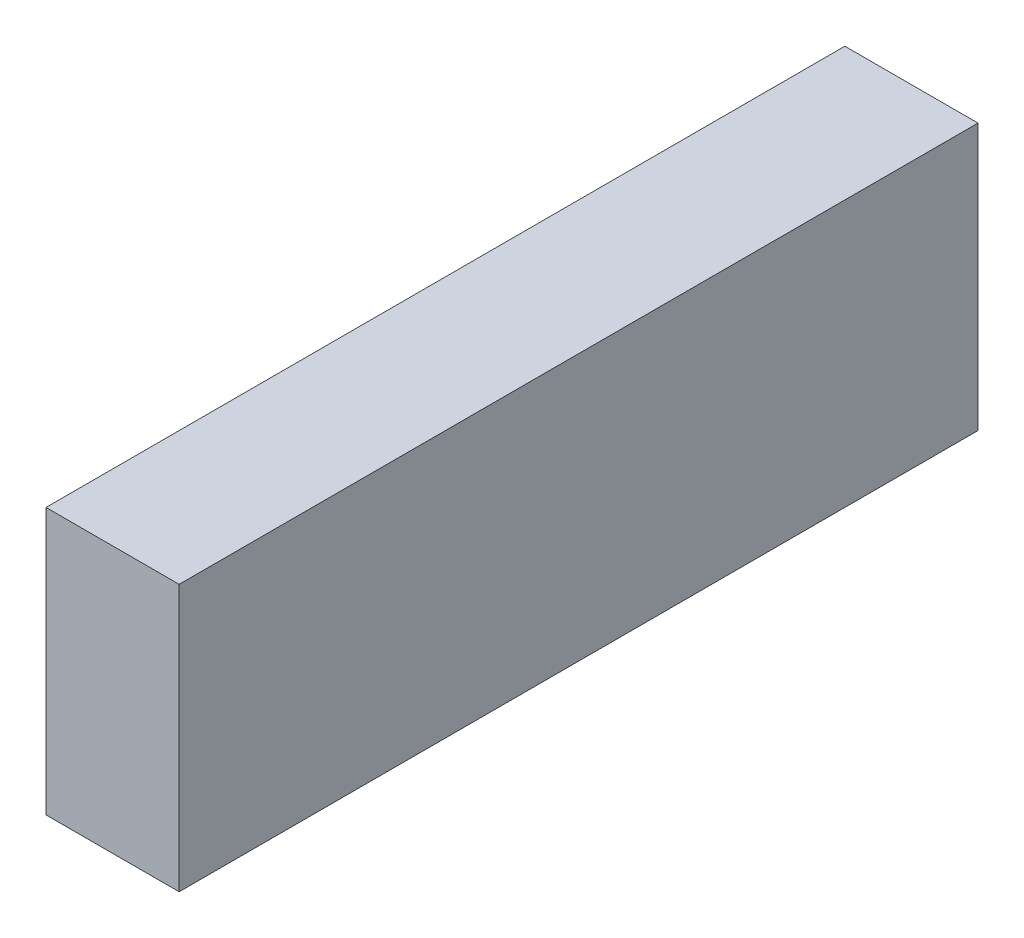
ISO-10303-21;
HEADER;
FILE_DESCRIPTION(('STEP AP214'),'2;1');
FILE_NAME('part.step','',(''),(''),'','','');
FILE_SCHEMA(('AUTOMOTIVE_DESIGN { 1 0 10303 214 1 1 1 1 }'));
ENDSEC;
DATA;
#1=APPLICATION_CONTEXT('core data for automotive mechanical design processes');
#2=APPLICATION_PROTOCOL_DEFINITION('international standard','automotive_design',2000,#1);
#3=PRODUCT_CONTEXT('',#1,'mechanical');
#4=PRODUCT('Part','Part','',(#3));
#5=PRODUCT_RELATED_PRODUCT_CATEGORY('part','',(#4));
#6=PRODUCT_DEFINITION_FORMATION('','',#4);
#7=PRODUCT_DEFINITION_CONTEXT('part definition',#1,'design');
#8=PRODUCT_DEFINITION('design','',#6,#7);
#9=PRODUCT_DEFINITION_SHAPE('','',#8);
#10=(LENGTH_UNIT() NAMED_UNIT(*) SI_UNIT(.MILLI.,.METRE.));
#11=(NAMED_UNIT(*) PLANE_ANGLE_UNIT() SI_UNIT($,.RADIAN.));
#12=(NAMED_UNIT(*) SI_UNIT($,.STERADIAN.) SOLID_ANGLE_UNIT());
#13=UNCERTAINTY_MEASURE_WITH_UNIT(LENGTH_MEASURE(1.E-05),#10,'distance_accuracy_value','');
#14=(GEOMETRIC_REPRESENTATION_CONTEXT(3) GLOBAL_UNCERTAINTY_ASSIGNED_CONTEXT((#13)) GLOBAL_UNIT_ASSIGNED_CONTEXT((#10,
#11,#12)) REPRESENTATION_CONTEXT('',''));
#15=CARTESIAN_POINT('',(0.,0.,0.));
#16=DIRECTION('',(0.,0.,1.));
#17=DIRECTION('',(1.,0.,0.));
#18=AXIS2_PLACEMENT_3D('',#15,#16,#17);
#19=CARTESIAN_POINT('',(-74.8394686190973,-22.3426301863668,15.));
#20=DIRECTION('',(-1.,0.,0.));
#21=DIRECTION('',(0.,0.,1.));
#22=AXIS2_PLACEMENT_3D('',#19,#20,#21);
#23=PLANE('',#22);
#24=DIRECTION('',(0.,1.,0.));
#25=VECTOR('',#24,1.);
#26=CARTESIAN_POINT('',(-74.8394686190973,-22.3426301863668,-15.));
#27=LINE('',#26,#25);
#28=CARTESIAN_POINT('',(-74.8394686190973,-32.3426301863668,-15.));
#29=VERTEX_POINT('',#28);
#30=CARTESIAN_POINT('',(-74.8394686190973,-22.3426301863668,-15.));
#31=VERTEX_POINT('',#30);
#32=EDGE_CURVE('E107',#29,#31,#27,.T.);
#33=ORIENTED_EDGE('',*,*,#32,.T.);
#34=DIRECTION('',(0.,0.,-1.));
#35=VECTOR('',#34,1.);
#36=CARTESIAN_POINT('',(-74.8394686190973,-22.3426301863668,15.));
#37=LINE('',#36,#35);
#38=CARTESIAN_POINT('',(-74.8394686190973,-22.3426301863668,15.));
#39=VERTEX_POINT('',#38);
#40=EDGE_CURVE('E11',#39,#31,#37,.T.);
#41=ORIENTED_EDGE('',*,*,#40,.F.);
#42=DIRECTION('',(0.,1.,0.));
#43=VECTOR('',#42,1.);
#44=CARTESIAN_POINT('',(-74.8394686190973,-22.3426301863668,15.));
#45=LINE('',#44,#43);
#46=CARTESIAN_POINT('',(-74.8394686190973,-32.3426301863668,15.));
#47=VERTEX_POINT('',#46);
#48=EDGE_CURVE('E91',#47,#39,#45,.T.);
#49=ORIENTED_EDGE('',*,*,#48,.F.);
#50=DIRECTION('',(0.,0.,-1.));
#51=VECTOR('',#50,1.);
#52=CARTESIAN_POINT('',(-74.8394686190973,-32.3426301863668,15.));
#53=LINE('',#52,#51);
#54=EDGE_CURVE('E103',#47,#29,#53,.T.);
#55=ORIENTED_EDGE('',*,*,#54,.T.);
#56=EDGE_LOOP('',(#33,#41,#49,#55));
#57=FACE_BOUND('',#56,.T.);
#58=ADVANCED_FACE('F39',(#57),#23,.F.);
#59=CARTESIAN_POINT('',(-79.8394686190973,-22.3426301863668,15.));
#60=DIRECTION('',(0.,-1.,0.));
#61=DIRECTION('',(0.,0.,-1.));
#62=AXIS2_PLACEMENT_3D('',#59,#60,#61);
#63=PLANE('',#62);
#64=DIRECTION('',(-1.,0.,0.));
#65=VECTOR('',#64,1.);
#66=CARTESIAN_POINT('',(-79.8394686190973,-22.3426301863668,-15.));
#67=LINE('',#66,#65);
#68=CARTESIAN_POINT('',(-79.8394686190973,-22.3426301863668,-15.));
#69=VERTEX_POINT('',#68);
#70=EDGE_CURVE('E96',#31,#69,#67,.T.);
#71=ORIENTED_EDGE('',*,*,#70,.T.);
#72=DIRECTION('',(0.,0.,-1.));
#73=VECTOR('',#72,1.);
#74=CARTESIAN_POINT('',(-79.8394686190973,-22.3426301863668,15.));
#75=LINE('',#74,#73);
#76=CARTESIAN_POINT('',(-79.8394686190973,-22.3426301863668,15.));
#77=VERTEX_POINT('',#76);
#78=EDGE_CURVE('E48',#77,#69,#75,.T.);
#79=ORIENTED_EDGE('',*,*,#78,.F.);
#80=DIRECTION('',(-1.,0.,0.));
#81=VECTOR('',#80,1.);
#82=CARTESIAN_POINT('',(-79.8394686190973,-22.3426301863668,15.));
#83=LINE('',#82,#81);
#84=EDGE_CURVE('E86',#39,#77,#83,.T.);
#85=ORIENTED_EDGE('',*,*,#84,.F.);
#86=ORIENTED_EDGE('',*,*,#40,.T.);
#87=EDGE_LOOP('',(#71,#79,#85,#86));
#88=FACE_BOUND('',#87,.T.);
#89=ADVANCED_FACE('F95',(#88),#63,.F.);
#90=CARTESIAN_POINT('',(-79.8394686190973,-22.3426301863668,15.));
#91=DIRECTION('',(1.,0.,0.));
#92=DIRECTION('',(0.,0.,-1.));
#93=AXIS2_PLACEMENT_3D('',#90,#91,#92);
#94=PLANE('',#93);
#95=DIRECTION('',(0.,-1.,0.));
#96=VECTOR('',#95,1.);
#97=CARTESIAN_POINT('',(-79.8394686190973,-22.3426301863668,-15.));
#98=LINE('',#97,#96);
#99=CARTESIAN_POINT('',(-79.8394686190973,-32.3426301863668,-15.));
#100=VERTEX_POINT('',#99);
#101=EDGE_CURVE('E73',#69,#100,#98,.T.);
#102=ORIENTED_EDGE('',*,*,#101,.T.);
#103=DIRECTION('',(0.,0.,-1.));
#104=VECTOR('',#103,1.);
#105=CARTESIAN_POINT('',(-79.8394686190973,-32.3426301863668,15.));
#106=LINE('',#105,#104);
#107=CARTESIAN_POINT('',(-79.8394686190973,-32.3426301863668,15.));
#108=VERTEX_POINT('',#107);
#109=EDGE_CURVE('E98',#108,#100,#106,.T.);
#110=ORIENTED_EDGE('',*,*,#109,.F.);
#111=DIRECTION('',(0.,-1.,0.));
#112=VECTOR('',#111,1.);
#113=CARTESIAN_POINT('',(-79.8394686190973,-22.3426301863668,15.));
#114=LINE('',#113,#112);
#115=EDGE_CURVE('E89',#77,#108,#114,.T.);
#116=ORIENTED_EDGE('',*,*,#115,.F.);
#117=ORIENTED_EDGE('',*,*,#78,.T.);
#118=EDGE_LOOP('',(#102,#110,#116,#117));
#119=FACE_BOUND('',#118,.T.);
#120=ADVANCED_FACE('F99',(#119),#94,.F.);
#121=CARTESIAN_POINT('',(-79.8394686190973,-32.3426301863668,15.));
#122=DIRECTION('',(0.,1.,0.));
#123=DIRECTION('',(0.,0.,1.));
#124=AXIS2_PLACEMENT_3D('',#121,#122,#123);
#125=PLANE('',#124);
#126=DIRECTION('',(1.,0.,0.));
#127=VECTOR('',#126,1.);
#128=CARTESIAN_POINT('',(-79.8394686190973,-32.3426301863668,-15.));
#129=LINE('',#128,#127);
#130=EDGE_CURVE('E79',#100,#29,#129,.T.);
#131=ORIENTED_EDGE('',*,*,#130,.T.);
#132=ORIENTED_EDGE('',*,*,#54,.F.);
#133=DIRECTION('',(1.,0.,0.));
#134=VECTOR('',#133,1.);
#135=CARTESIAN_POINT('',(-79.8394686190973,-32.3426301863668,15.));
#136=LINE('',#135,#134);
#137=EDGE_CURVE('E56',#108,#47,#136,.T.);
#138=ORIENTED_EDGE('',*,*,#137,.F.);
#139=ORIENTED_EDGE('',*,*,#109,.T.);
#140=EDGE_LOOP('',(#131,#132,#138,#139));
#141=FACE_BOUND('',#140,.T.);
#142=ADVANCED_FACE('F120',(#141),#125,.F.);
#143=CARTESIAN_POINT('',(0.,0.,15.));
#144=DIRECTION('',(0.,0.,1.));
#145=DIRECTION('',(1.,0.,0.));
#146=AXIS2_PLACEMENT_3D('',#143,#144,#145);
#147=PLANE('',#146);
#148=ORIENTED_EDGE('',*,*,#48,.T.);
#149=ORIENTED_EDGE('',*,*,#84,.T.);
#150=ORIENTED_EDGE('',*,*,#115,.T.);
#151=ORIENTED_EDGE('',*,*,#137,.T.);
#152=EDGE_LOOP('',(#148,#149,#150,#151));
#153=FACE_BOUND('',#152,.T.);
#154=ADVANCED_FACE('F87',(#153),#147,.T.);
#155=CARTESIAN_POINT('',(0.,0.,-15.));
#156=DIRECTION('',(0.,0.,1.));
#157=DIRECTION('',(1.,0.,0.));
#158=AXIS2_PLACEMENT_3D('',#155,#156,#157);
#159=PLANE('',#158);
#160=ORIENTED_EDGE('',*,*,#32,.F.);
#161=ORIENTED_EDGE('',*,*,#130,.F.);
#162=ORIENTED_EDGE('',*,*,#101,.F.);
#163=ORIENTED_EDGE('',*,*,#70,.F.);
#164=EDGE_LOOP('',(#160,#161,#162,#163));
#165=FACE_BOUND('',#164,.T.);
#166=ADVANCED_FACE('F123',(#165),#159,.F.);
#167=CLOSED_SHELL('',(#58,#89,#120,#142,#154,#166));
#168=MANIFOLD_SOLID_BREP('B2',#167);
#169=ADVANCED_BREP_SHAPE_REPRESENTATION('',(#18,#168),#14);
#170=SHAPE_DEFINITION_REPRESENTATION(#9,#169);
ENDSEC;
END-ISO-10303-21;
